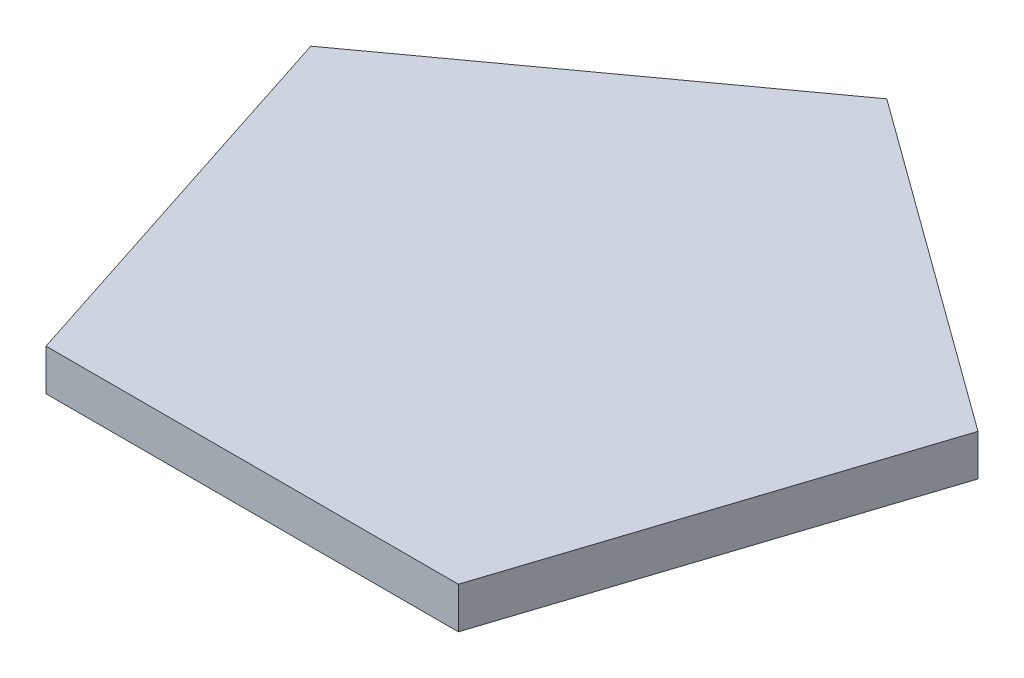
ISO-10303-21;
HEADER;
FILE_DESCRIPTION(('STEP AP214'),'2;1');
FILE_NAME('part.step','',(''),(''),'','','');
FILE_SCHEMA(('AUTOMOTIVE_DESIGN { 1 0 10303 214 1 1 1 1 }'));
ENDSEC;
DATA;
#1=APPLICATION_CONTEXT('core data for automotive mechanical design processes');
#2=APPLICATION_PROTOCOL_DEFINITION('international standard','automotive_design',2000,#1);
#3=PRODUCT_CONTEXT('',#1,'mechanical');
#4=PRODUCT('Part','Part','',(#3));
#5=PRODUCT_RELATED_PRODUCT_CATEGORY('part','',(#4));
#6=PRODUCT_DEFINITION_FORMATION('','',#4);
#7=PRODUCT_DEFINITION_CONTEXT('part definition',#1,'design');
#8=PRODUCT_DEFINITION('design','',#6,#7);
#9=PRODUCT_DEFINITION_SHAPE('','',#8);
#10=(LENGTH_UNIT() NAMED_UNIT(*) SI_UNIT(.MILLI.,.METRE.));
#11=(NAMED_UNIT(*) PLANE_ANGLE_UNIT() SI_UNIT($,.RADIAN.));
#12=(NAMED_UNIT(*) SI_UNIT($,.STERADIAN.) SOLID_ANGLE_UNIT());
#13=UNCERTAINTY_MEASURE_WITH_UNIT(LENGTH_MEASURE(1.E-05),#10,'distance_accuracy_value','');
#14=(GEOMETRIC_REPRESENTATION_CONTEXT(3) GLOBAL_UNCERTAINTY_ASSIGNED_CONTEXT((#13)) GLOBAL_UNIT_ASSIGNED_CONTEXT((#10,
#11,#12)) REPRESENTATION_CONTEXT('',''));
#15=CARTESIAN_POINT('',(0.,0.,0.));
#16=DIRECTION('',(0.,0.,1.));
#17=DIRECTION('',(1.,0.,0.));
#18=AXIS2_PLACEMENT_3D('',#15,#16,#17);
#19=CARTESIAN_POINT('',(20.5490316571237,2.54,-6.67678512391299));
#20=DIRECTION('',(-0.587785252292473,0.,0.809016994374947));
#21=DIRECTION('',(0.809016994374947,0.,0.587785252292473));
#22=AXIS2_PLACEMENT_3D('',#19,#20,#21);
#23=PLANE('',#22);
#24=DIRECTION('',(-0.809016994374947,0.,-0.587785252292473));
#25=VECTOR('',#24,1.);
#26=CARTESIAN_POINT('',(20.5490316571237,0.,-6.67678512391299));
#27=LINE('',#26,#25);
#28=CARTESIAN_POINT('',(20.5490316571237,0.,-6.67678512391299));
#29=VERTEX_POINT('',#28);
#30=CARTESIAN_POINT('',(0.,0.,-21.6065305321418));
#31=VERTEX_POINT('',#30);
#32=EDGE_CURVE('E107',#29,#31,#27,.T.);
#33=ORIENTED_EDGE('',*,*,#32,.T.);
#34=DIRECTION('',(0.,-1.,0.));
#35=VECTOR('',#34,1.);
#36=CARTESIAN_POINT('',(0.,2.54,-21.6065305321418));
#37=LINE('',#36,#35);
#38=CARTESIAN_POINT('',(0.,2.54,-21.6065305321418));
#39=VERTEX_POINT('',#38);
#40=EDGE_CURVE('E11',#39,#31,#37,.T.);
#41=ORIENTED_EDGE('',*,*,#40,.F.);
#42=DIRECTION('',(-0.809016994374947,0.,-0.587785252292473));
#43=VECTOR('',#42,1.);
#44=CARTESIAN_POINT('',(20.5490316571237,2.54,-6.67678512391299));
#45=LINE('',#44,#43);
#46=CARTESIAN_POINT('',(20.5490316571237,2.54,-6.67678512391299));
#47=VERTEX_POINT('',#46);
#48=EDGE_CURVE('E115',#47,#39,#45,.T.);
#49=ORIENTED_EDGE('',*,*,#48,.F.);
#50=DIRECTION('',(0.,-1.,0.));
#51=VECTOR('',#50,1.);
#52=CARTESIAN_POINT('',(20.5490316571237,2.54,-6.67678512391299));
#53=LINE('',#52,#51);
#54=EDGE_CURVE('E103',#47,#29,#53,.T.);
#55=ORIENTED_EDGE('',*,*,#54,.T.);
#56=EDGE_LOOP('',(#33,#41,#49,#55));
#57=FACE_BOUND('',#56,.T.);
#58=ADVANCED_FACE('F33',(#57),#23,.F.);
#59=CARTESIAN_POINT('',(0.,2.54,-21.6065305321418));
#60=DIRECTION('',(0.587785252292473,0.,0.809016994374948));
#61=DIRECTION('',(0.809016994374948,0.,-0.587785252292473));
#62=AXIS2_PLACEMENT_3D('',#59,#60,#61);
#63=PLANE('',#62);
#64=DIRECTION('',(-0.809016994374948,0.,0.587785252292473));
#65=VECTOR('',#64,1.);
#66=CARTESIAN_POINT('',(0.,0.,-21.6065305321418));
#67=LINE('',#66,#65);
#68=CARTESIAN_POINT('',(-20.5490316571237,0.,-6.67678512391301));
#69=VERTEX_POINT('',#68);
#70=EDGE_CURVE('E110',#31,#69,#67,.T.);
#71=ORIENTED_EDGE('',*,*,#70,.T.);
#72=DIRECTION('',(0.,-1.,0.));
#73=VECTOR('',#72,1.);
#74=CARTESIAN_POINT('',(-20.5490316571237,2.54,-6.67678512391301));
#75=LINE('',#74,#73);
#76=CARTESIAN_POINT('',(-20.5490316571237,2.54,-6.67678512391301));
#77=VERTEX_POINT('',#76);
#78=EDGE_CURVE('E41',#77,#69,#75,.T.);
#79=ORIENTED_EDGE('',*,*,#78,.F.);
#80=DIRECTION('',(-0.809016994374948,0.,0.587785252292473));
#81=VECTOR('',#80,1.);
#82=CARTESIAN_POINT('',(0.,2.54,-21.6065305321418));
#83=LINE('',#82,#81);
#84=EDGE_CURVE('E83',#39,#77,#83,.T.);
#85=ORIENTED_EDGE('',*,*,#84,.F.);
#86=ORIENTED_EDGE('',*,*,#40,.T.);
#87=EDGE_LOOP('',(#71,#79,#85,#86));
#88=FACE_BOUND('',#87,.T.);
#89=ADVANCED_FACE('F134',(#88),#63,.F.);
#90=CARTESIAN_POINT('',(-20.5490316571237,2.54,-6.67678512391301));
#91=DIRECTION('',(0.951056516295154,0.,-0.309016994374947));
#92=DIRECTION('',(-0.309016994374947,0.,-0.951056516295154));
#93=AXIS2_PLACEMENT_3D('',#90,#91,#92);
#94=PLANE('',#93);
#95=DIRECTION('',(0.309016994374947,0.,0.951056516295154));
#96=VECTOR('',#95,1.);
#97=CARTESIAN_POINT('',(-20.5490316571237,0.,-6.67678512391301));
#98=LINE('',#97,#96);
#99=CARTESIAN_POINT('',(-12.7,0.,17.4800503899839));
#100=VERTEX_POINT('',#99);
#101=EDGE_CURVE('E98',#69,#100,#98,.T.);
#102=ORIENTED_EDGE('',*,*,#101,.T.);
#103=DIRECTION('',(0.,-1.,0.));
#104=VECTOR('',#103,1.);
#105=CARTESIAN_POINT('',(-12.7,2.54,17.4800503899839));
#106=LINE('',#105,#104);
#107=CARTESIAN_POINT('',(-12.7,2.54,17.4800503899839));
#108=VERTEX_POINT('',#107);
#109=EDGE_CURVE('E95',#108,#100,#106,.T.);
#110=ORIENTED_EDGE('',*,*,#109,.F.);
#111=DIRECTION('',(0.309016994374947,0.,0.951056516295154));
#112=VECTOR('',#111,1.);
#113=CARTESIAN_POINT('',(-20.5490316571237,2.54,-6.67678512391301));
#114=LINE('',#113,#112);
#115=EDGE_CURVE('E87',#77,#108,#114,.T.);
#116=ORIENTED_EDGE('',*,*,#115,.F.);
#117=ORIENTED_EDGE('',*,*,#78,.T.);
#118=EDGE_LOOP('',(#102,#110,#116,#117));
#119=FACE_BOUND('',#118,.T.);
#120=ADVANCED_FACE('F96',(#119),#94,.F.);
#121=CARTESIAN_POINT('',(-12.7,2.54,17.4800503899839));
#122=DIRECTION('',(0.,0.,-1.));
#123=DIRECTION('',(-1.,0.,0.));
#124=AXIS2_PLACEMENT_3D('',#121,#122,#123);
#125=PLANE('',#124);
#126=DIRECTION('',(1.,0.,0.));
#127=VECTOR('',#126,1.);
#128=CARTESIAN_POINT('',(-12.7,0.,17.4800503899839));
#129=LINE('',#128,#127);
#130=CARTESIAN_POINT('',(12.7,0.,17.4800503899839));
#131=VERTEX_POINT('',#130);
#132=EDGE_CURVE('E69',#100,#131,#129,.T.);
#133=ORIENTED_EDGE('',*,*,#132,.T.);
#134=DIRECTION('',(0.,-1.,0.));
#135=VECTOR('',#134,1.);
#136=CARTESIAN_POINT('',(12.7,2.54,17.4800503899839));
#137=LINE('',#136,#135);
#138=CARTESIAN_POINT('',(12.7,2.54,17.4800503899839));
#139=VERTEX_POINT('',#138);
#140=EDGE_CURVE('E99',#139,#131,#137,.T.);
#141=ORIENTED_EDGE('',*,*,#140,.F.);
#142=DIRECTION('',(1.,0.,0.));
#143=VECTOR('',#142,1.);
#144=CARTESIAN_POINT('',(-12.7,2.54,17.4800503899839));
#145=LINE('',#144,#143);
#146=EDGE_CURVE('E91',#108,#139,#145,.T.);
#147=ORIENTED_EDGE('',*,*,#146,.F.);
#148=ORIENTED_EDGE('',*,*,#109,.T.);
#149=EDGE_LOOP('',(#133,#141,#147,#148));
#150=FACE_BOUND('',#149,.T.);
#151=ADVANCED_FACE('F101',(#150),#125,.F.);
#152=CARTESIAN_POINT('',(12.7,2.54,17.4800503899839));
#153=DIRECTION('',(-0.951056516295154,0.,-0.309016994374948));
#154=DIRECTION('',(-0.309016994374948,0.,0.951056516295154));
#155=AXIS2_PLACEMENT_3D('',#152,#153,#154);
#156=PLANE('',#155);
#157=DIRECTION('',(0.309016994374948,0.,-0.951056516295154));
#158=VECTOR('',#157,1.);
#159=CARTESIAN_POINT('',(12.7,0.,17.4800503899839));
#160=LINE('',#159,#158);
#161=EDGE_CURVE('E75',#131,#29,#160,.T.);
#162=ORIENTED_EDGE('',*,*,#161,.T.);
#163=ORIENTED_EDGE('',*,*,#54,.F.);
#164=DIRECTION('',(0.309016994374948,0.,-0.951056516295154));
#165=VECTOR('',#164,1.);
#166=CARTESIAN_POINT('',(12.7,2.54,17.4800503899839));
#167=LINE('',#166,#165);
#168=EDGE_CURVE('E49',#139,#47,#167,.T.);
#169=ORIENTED_EDGE('',*,*,#168,.F.);
#170=ORIENTED_EDGE('',*,*,#140,.T.);
#171=EDGE_LOOP('',(#162,#163,#169,#170));
#172=FACE_BOUND('',#171,.T.);
#173=ADVANCED_FACE('F123',(#172),#156,.F.);
#174=CARTESIAN_POINT('',(0.,2.54,0.));
#175=DIRECTION('',(0.,1.,0.));
#176=DIRECTION('',(0.,0.,1.));
#177=AXIS2_PLACEMENT_3D('',#174,#175,#176);
#178=PLANE('',#177);
#179=ORIENTED_EDGE('',*,*,#48,.T.);
#180=ORIENTED_EDGE('',*,*,#84,.T.);
#181=ORIENTED_EDGE('',*,*,#115,.T.);
#182=ORIENTED_EDGE('',*,*,#146,.T.);
#183=ORIENTED_EDGE('',*,*,#168,.T.);
#184=EDGE_LOOP('',(#179,#180,#181,#182,#183));
#185=FACE_BOUND('',#184,.T.);
#186=ADVANCED_FACE('F89',(#185),#178,.T.);
#187=CARTESIAN_POINT('',(0.,0.,0.));
#188=DIRECTION('',(0.,1.,0.));
#189=DIRECTION('',(0.,0.,1.));
#190=AXIS2_PLACEMENT_3D('',#187,#188,#189);
#191=PLANE('',#190);
#192=ORIENTED_EDGE('',*,*,#32,.F.);
#193=ORIENTED_EDGE('',*,*,#161,.F.);
#194=ORIENTED_EDGE('',*,*,#132,.F.);
#195=ORIENTED_EDGE('',*,*,#101,.F.);
#196=ORIENTED_EDGE('',*,*,#70,.F.);
#197=EDGE_LOOP('',(#192,#193,#194,#195,#196));
#198=FACE_BOUND('',#197,.T.);
#199=ADVANCED_FACE('F119',(#198),#191,.F.);
#200=CLOSED_SHELL('',(#58,#89,#120,#151,#173,#186,#199));
#201=MANIFOLD_SOLID_BREP('B2',#200);
#202=ADVANCED_BREP_SHAPE_REPRESENTATION('',(#18,#201),#14);
#203=SHAPE_DEFINITION_REPRESENTATION(#9,#202);
ENDSEC;
END-ISO-10303-21;
